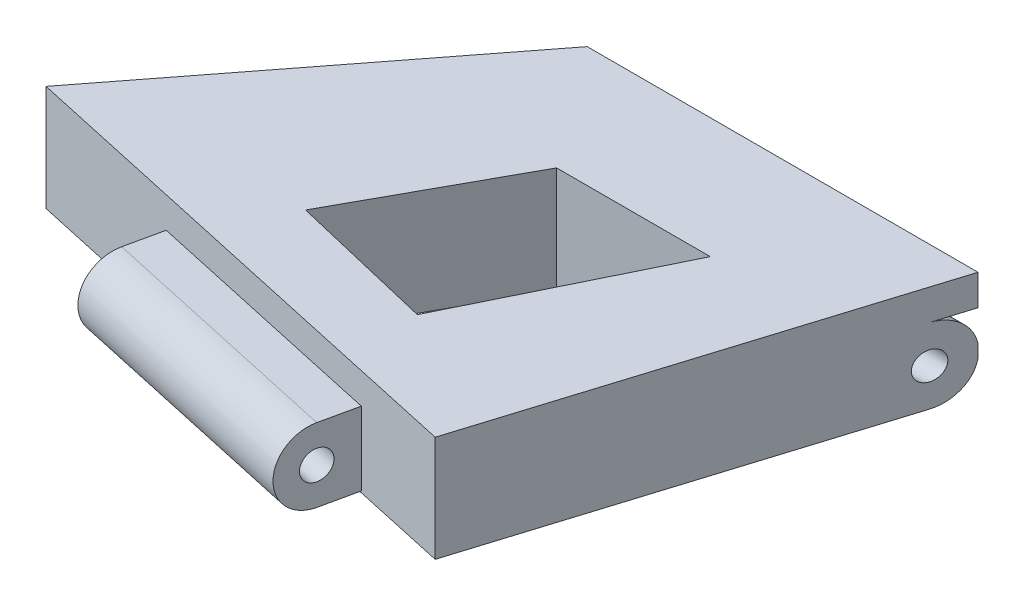
ISO-10303-21;
HEADER;
FILE_DESCRIPTION(('STEP AP214'),'2;1');
FILE_NAME('part.step','',(''),(''),'','','');
FILE_SCHEMA(('AUTOMOTIVE_DESIGN { 1 0 10303 214 1 1 1 1 }'));
ENDSEC;
DATA;
#1=APPLICATION_CONTEXT('core data for automotive mechanical design processes');
#2=APPLICATION_PROTOCOL_DEFINITION('international standard','automotive_design',2000,#1);
#3=PRODUCT_CONTEXT('',#1,'mechanical');
#4=PRODUCT('Part','Part','',(#3));
#5=PRODUCT_RELATED_PRODUCT_CATEGORY('part','',(#4));
#6=PRODUCT_DEFINITION_FORMATION('','',#4);
#7=PRODUCT_DEFINITION_CONTEXT('part definition',#1,'design');
#8=PRODUCT_DEFINITION('design','',#6,#7);
#9=PRODUCT_DEFINITION_SHAPE('','',#8);
#10=(LENGTH_UNIT() NAMED_UNIT(*) SI_UNIT(.MILLI.,.METRE.));
#11=(NAMED_UNIT(*) PLANE_ANGLE_UNIT() SI_UNIT($,.RADIAN.));
#12=(NAMED_UNIT(*) SI_UNIT($,.STERADIAN.) SOLID_ANGLE_UNIT());
#13=UNCERTAINTY_MEASURE_WITH_UNIT(LENGTH_MEASURE(1.E-05),#10,'distance_accuracy_value','');
#14=(GEOMETRIC_REPRESENTATION_CONTEXT(3) GLOBAL_UNCERTAINTY_ASSIGNED_CONTEXT((#13)) GLOBAL_UNIT_ASSIGNED_CONTEXT((#10,
#11,#12)) REPRESENTATION_CONTEXT('',''));
#15=CARTESIAN_POINT('',(0.,0.,0.));
#16=DIRECTION('',(0.,0.,1.));
#17=DIRECTION('',(1.,0.,0.));
#18=AXIS2_PLACEMENT_3D('',#15,#16,#17);
#19=CARTESIAN_POINT('',(0.,15.24,0.));
#20=DIRECTION('',(0.,0.,1.));
#21=DIRECTION('',(1.,0.,0.));
#22=AXIS2_PLACEMENT_3D('',#19,#20,#21);
#23=PLANE('',#22);
#24=DIRECTION('',(1.,0.,0.));
#25=VECTOR('',#24,1.);
#26=CARTESIAN_POINT('',(-10.8042377561624,12.7,0.));
#27=LINE('',#26,#25);
#28=CARTESIAN_POINT('',(0.,12.7,0.));
#29=VERTEX_POINT('',#28);
#30=CARTESIAN_POINT('',(19.0568112466378,12.7,0.));
#31=VERTEX_POINT('',#30);
#32=EDGE_CURVE('E278',#29,#31,#27,.T.);
#33=ORIENTED_EDGE('',*,*,#32,.T.);
#34=DIRECTION('',(0.,-1.,0.));
#35=VECTOR('',#34,1.);
#36=CARTESIAN_POINT('',(19.0568112466378,15.24,0.));
#37=LINE('',#36,#35);
#38=CARTESIAN_POINT('',(19.0568112466378,6.50687140227221,0.));
#39=VERTEX_POINT('',#38);
#40=EDGE_CURVE('E413',#31,#39,#37,.T.);
#41=ORIENTED_EDGE('',*,*,#40,.T.);
#42=DIRECTION('',(-1.,0.,0.));
#43=VECTOR('',#42,1.);
#44=CARTESIAN_POINT('',(33.782,6.50687140227221,0.));
#45=LINE('',#44,#43);
#46=CARTESIAN_POINT('',(0.,6.50687140227221,0.));
#47=VERTEX_POINT('',#46);
#48=EDGE_CURVE('E312',#39,#47,#45,.T.);
#49=ORIENTED_EDGE('',*,*,#48,.T.);
#50=DIRECTION('',(0.,-1.,0.));
#51=VECTOR('',#50,1.);
#52=CARTESIAN_POINT('',(0.,15.24,0.));
#53=LINE('',#52,#51);
#54=EDGE_CURVE('E410',#29,#47,#53,.T.);
#55=ORIENTED_EDGE('',*,*,#54,.F.);
#56=EDGE_LOOP('',(#33,#41,#49,#55));
#57=FACE_BOUND('',#56,.T.);
#58=ADVANCED_FACE('F115',(#57),#23,.F.);
#59=CARTESIAN_POINT('',(0.,15.24,0.));
#60=DIRECTION('',(0.,1.,0.));
#61=DIRECTION('',(0.,0.,1.));
#62=AXIS2_PLACEMENT_3D('',#59,#60,#61);
#63=PLANE('',#62);
#64=DIRECTION('',(0.296374888035305,0.,-0.955071686179661));
#65=VECTOR('',#64,1.);
#66=CARTESIAN_POINT('',(26.1739973577642,15.24,-6.09789291124779));
#67=LINE('',#66,#65);
#68=CARTESIAN_POINT('',(15.5632254721542,15.24,28.0954487164345));
#69=VERTEX_POINT('',#68);
#70=CARTESIAN_POINT('',(26.1739973577642,15.24,-6.09789291124779));
#71=VERTEX_POINT('',#70);
#72=EDGE_CURVE('E408',#69,#71,#67,.T.);
#73=ORIENTED_EDGE('',*,*,#72,.T.);
#74=DIRECTION('',(-1.,0.,0.));
#75=VECTOR('',#74,1.);
#76=CARTESIAN_POINT('',(26.1739973577642,15.24,-6.09789291124779));
#77=LINE('',#76,#75);
#78=CARTESIAN_POINT('',(-6.0827445987543,15.24,-6.09789291124779));
#79=VERTEX_POINT('',#78);
#80=EDGE_CURVE('E285',#71,#79,#77,.T.);
#81=ORIENTED_EDGE('',*,*,#80,.T.);
#82=DIRECTION('',(-0.612217280034448,0.,0.790689573743845));
#83=VECTOR('',#82,1.);
#84=CARTESIAN_POINT('',(-6.0827445987543,15.24,-6.09789291124779));
#85=LINE('',#84,#83);
#86=CARTESIAN_POINT('',(-25.576280294875,15.24,19.0783573073982));
#87=VERTEX_POINT('',#86);
#88=EDGE_CURVE('E404',#79,#87,#85,.T.);
#89=ORIENTED_EDGE('',*,*,#88,.T.);
#90=DIRECTION('',(0.976811581586904,0.,0.214100756835867));
#91=VECTOR('',#90,1.);
#92=CARTESIAN_POINT('',(-25.576280294875,15.24,19.0783573073982));
#93=LINE('',#92,#91);
#94=EDGE_CURVE('E406',#87,#69,#93,.T.);
#95=ORIENTED_EDGE('',*,*,#94,.T.);
#96=EDGE_LOOP('',(#73,#81,#89,#95));
#97=FACE_BOUND('',#96,.T.);
#98=DIRECTION('',(-0.439450333434113,0.,0.898266889317783));
#99=VECTOR('',#98,1.);
#100=CARTESIAN_POINT('',(12.8171164584671,15.24,6.27039265091359));
#101=LINE('',#100,#99);
#102=CARTESIAN_POINT('',(14.0089507072881,15.24,3.83420097731839));
#103=VERTEX_POINT('',#102);
#104=CARTESIAN_POINT('',(6.06632519195569,15.24,20.0694771208587));
#105=VERTEX_POINT('',#104);
#106=EDGE_CURVE('E300',#103,#105,#101,.T.);
#107=ORIENTED_EDGE('',*,*,#106,.T.);
#108=DIRECTION('',(-0.97303332595613,0.,-0.230664575907856));
#109=VECTOR('',#108,1.);
#110=CARTESIAN_POINT('',(-4.18171434727036,15.24,17.6401053499796));
#111=LINE('',#110,#109);
#112=CARTESIAN_POINT('',(-6.02887631894472,15.24,17.2022222667761));
#113=VERTEX_POINT('',#112);
#114=EDGE_CURVE('E130',#105,#113,#111,.T.);
#115=ORIENTED_EDGE('',*,*,#114,.T.);
#116=DIRECTION('',(-0.481767188770831,0.,0.876299250155933));
#117=VECTOR('',#116,1.);
#118=CARTESIAN_POINT('',(2.63272408003637,15.24,1.44740518564029));
#119=LINE('',#118,#117);
#120=CARTESIAN_POINT('',(1.3205240541637,15.24,3.83420097731839));
#121=VERTEX_POINT('',#120);
#122=EDGE_CURVE('E306',#121,#113,#119,.T.);
#123=ORIENTED_EDGE('',*,*,#122,.F.);
#124=DIRECTION('',(1.,0.,0.));
#125=VECTOR('',#124,1.);
#126=CARTESIAN_POINT('',(0.,15.24,3.83420097731839));
#127=LINE('',#126,#125);
#128=EDGE_CURVE('E303',#121,#103,#127,.T.);
#129=ORIENTED_EDGE('',*,*,#128,.T.);
#130=EDGE_LOOP('',(#107,#115,#123,#129));
#131=FACE_BOUND('',#130,.T.);
#132=ADVANCED_FACE('F468',(#97,#131),#63,.T.);
#133=CARTESIAN_POINT('',(-18.5351887533622,6.50687140227221,0.));
#134=DIRECTION('',(0.,1.,0.));
#135=DIRECTION('',(0.,0.,1.));
#136=AXIS2_PLACEMENT_3D('',#133,#134,#135);
#137=PLANE('',#136);
#138=DIRECTION('',(0.,0.,-1.));
#139=VECTOR('',#138,1.);
#140=CARTESIAN_POINT('',(0.,6.50687140227221,0.));
#141=LINE('',#140,#139);
#142=CARTESIAN_POINT('',(0.,6.50687140227221,-3.04894645562389));
#143=VERTEX_POINT('',#142);
#144=EDGE_CURVE('E349',#47,#143,#141,.T.);
#145=ORIENTED_EDGE('',*,*,#144,.F.);
#146=ORIENTED_EDGE('',*,*,#48,.F.);
#147=DIRECTION('',(0.,0.,1.));
#148=VECTOR('',#147,1.);
#149=CARTESIAN_POINT('',(19.0568112466378,6.50687140227221,0.));
#150=LINE('',#149,#148);
#151=CARTESIAN_POINT('',(19.0568112466378,6.50687140227221,-3.04894645562389));
#152=VERTEX_POINT('',#151);
#153=EDGE_CURVE('E346',#152,#39,#150,.T.);
#154=ORIENTED_EDGE('',*,*,#153,.F.);
#155=DIRECTION('',(1.,0.,0.));
#156=VECTOR('',#155,1.);
#157=CARTESIAN_POINT('',(-18.5351887533622,6.50687140227221,-3.04894645562389));
#158=LINE('',#157,#156);
#159=CARTESIAN_POINT('',(25.2278577354854,6.50687140227221,-3.04894645562389));
#160=VERTEX_POINT('',#159);
#161=EDGE_CURVE('E322',#152,#160,#158,.T.);
#162=ORIENTED_EDGE('',*,*,#161,.T.);
#163=DIRECTION('',(0.296374888035305,0.,-0.955071686179661));
#164=VECTOR('',#163,1.);
#165=CARTESIAN_POINT('',(26.1739973577642,6.50687140227221,-6.09789291124779));
#166=LINE('',#165,#164);
#167=CARTESIAN_POINT('',(15.5632254721542,6.50687140227221,28.0954487164345));
#168=VERTEX_POINT('',#167);
#169=EDGE_CURVE('E341',#168,#160,#166,.T.);
#170=ORIENTED_EDGE('',*,*,#169,.F.);
#171=DIRECTION('',(-0.976811581586904,0.,-0.214100756835867));
#172=VECTOR('',#171,1.);
#173=CARTESIAN_POINT('',(7.75241867234352,6.50687140227221,26.3834505390363));
#174=LINE('',#173,#172);
#175=CARTESIAN_POINT('',(-25.576280294875,6.50687140227221,19.0783573073982));
#176=VERTEX_POINT('',#175);
#177=EDGE_CURVE('E318',#168,#176,#174,.T.);
#178=ORIENTED_EDGE('',*,*,#177,.T.);
#179=DIRECTION('',(-0.612217280034448,0.,0.790689573743845));
#180=VECTOR('',#179,1.);
#181=CARTESIAN_POINT('',(-6.0827445987543,6.50687140227221,-6.09789291124779));
#182=LINE('',#181,#180);
#183=CARTESIAN_POINT('',(-8.44349117745833,6.50687140227221,-3.04894645562389));
#184=VERTEX_POINT('',#183);
#185=EDGE_CURVE('E344',#184,#176,#182,.T.);
#186=ORIENTED_EDGE('',*,*,#185,.F.);
#187=EDGE_CURVE('E325',#184,#143,#158,.T.);
#188=ORIENTED_EDGE('',*,*,#187,.T.);
#189=EDGE_LOOP('',(#145,#146,#154,#162,#170,#178,#186,#188));
#190=FACE_BOUND('',#189,.T.);
#191=DIRECTION('',(-0.97303332595613,0.,-0.230664575907856));
#192=VECTOR('',#191,1.);
#193=CARTESIAN_POINT('',(-21.7307171309564,6.50687140227221,13.4799875238741));
#194=LINE('',#193,#192);
#195=CARTESIAN_POINT('',(6.06632519195569,6.50687140227221,20.0694771208587));
#196=VERTEX_POINT('',#195);
#197=CARTESIAN_POINT('',(-6.02887631894472,6.50687140227221,17.2022222667761));
#198=VERTEX_POINT('',#197);
#199=EDGE_CURVE('E12',#196,#198,#194,.T.);
#200=ORIENTED_EDGE('',*,*,#199,.F.);
#201=DIRECTION('',(-0.439450333434113,0.,0.898266889317783));
#202=VECTOR('',#201,1.);
#203=CARTESIAN_POINT('',(9.23766390844195,6.50687140227221,13.5870413434872));
#204=LINE('',#203,#202);
#205=CARTESIAN_POINT('',(14.0089507072881,6.50687140227221,3.83420097731839));
#206=VERTEX_POINT('',#205);
#207=EDGE_CURVE('E450',#206,#196,#204,.T.);
#208=ORIENTED_EDGE('',*,*,#207,.F.);
#209=DIRECTION('',(1.,0.,0.));
#210=VECTOR('',#209,1.);
#211=CARTESIAN_POINT('',(-18.5351887533622,6.50687140227221,3.83420097731839));
#212=LINE('',#211,#210);
#213=CARTESIAN_POINT('',(1.3205240541637,6.50687140227221,3.83420097731839));
#214=VERTEX_POINT('',#213);
#215=EDGE_CURVE('E452',#214,#206,#212,.T.);
#216=ORIENTED_EDGE('',*,*,#215,.F.);
#217=DIRECTION('',(-0.481767188770831,0.,0.876299250155933));
#218=VECTOR('',#217,1.);
#219=CARTESIAN_POINT('',(-1.66928626365299,6.50687140227221,9.27244708597467));
#220=LINE('',#219,#218);
#221=EDGE_CURVE('E123',#214,#198,#220,.T.);
#222=ORIENTED_EDGE('',*,*,#221,.T.);
#223=EDGE_LOOP('',(#200,#208,#216,#222));
#224=FACE_BOUND('',#223,.T.);
#225=ADVANCED_FACE('F457',(#190,#224),#137,.F.);
#226=CARTESIAN_POINT('',(-6.0827445987543,15.24,-6.09789291124779));
#227=DIRECTION('',(0.790689573743845,0.,0.612217280034448));
#228=DIRECTION('',(0.612217280034448,0.,-0.790689573743845));
#229=AXIS2_PLACEMENT_3D('',#226,#227,#228);
#230=PLANE('',#229);
#231=ORIENTED_EDGE('',*,*,#88,.F.);
#232=DIRECTION('',(0.,1.,0.));
#233=VECTOR('',#232,1.);
#234=CARTESIAN_POINT('',(-6.0827445987543,12.7,-6.09789291124779));
#235=LINE('',#234,#233);
#236=CARTESIAN_POINT('',(-6.0827445987543,12.7,-6.09789291124779));
#237=VERTEX_POINT('',#236);
#238=EDGE_CURVE('E286',#237,#79,#235,.T.);
#239=ORIENTED_EDGE('',*,*,#238,.F.);
#240=DIRECTION('',(-0.612217280034448,0.,0.790689573743845));
#241=VECTOR('',#240,1.);
#242=CARTESIAN_POINT('',(-6.0827445987543,12.7,-6.09789291124779));
#243=LINE('',#242,#241);
#244=CARTESIAN_POINT('',(-8.44349117745833,12.7,-3.0489464556239));
#245=VERTEX_POINT('',#244);
#246=EDGE_CURVE('E293',#237,#245,#243,.T.);
#247=ORIENTED_EDGE('',*,*,#246,.T.);
#248=CARTESIAN_POINT('',(-8.44349117745833,9.60343570113611,-3.04894645562389));
#249=DIRECTION('',(0.790689573743845,0.,0.612217280034448));
#250=DIRECTION('',(-0.612217280034448,0.,0.790689573743845));
#251=AXIS2_PLACEMENT_3D('',#248,#249,#250);
#252=ELLIPSE('',#251,3.91628320606524,3.0965642988639);
#253=CARTESIAN_POINT('',(-6.0827445987543,10.1443940800683,-6.09789291124779));
#254=VERTEX_POINT('',#253);
#255=EDGE_CURVE('E334',#254,#245,#252,.T.);
#256=ORIENTED_EDGE('',*,*,#255,.F.);
#257=DIRECTION('',(0.,-1.,0.));
#258=VECTOR('',#257,1.);
#259=CARTESIAN_POINT('',(-6.0827445987543,15.24,-6.09789291124779));
#260=LINE('',#259,#258);
#261=CARTESIAN_POINT('',(-6.0827445987543,9.0624773222039,-6.09789291124779));
#262=VERTEX_POINT('',#261);
#263=EDGE_CURVE('E434',#254,#262,#260,.T.);
#264=ORIENTED_EDGE('',*,*,#263,.T.);
#265=CARTESIAN_POINT('',(-8.44349117745833,9.60343570113611,-3.04894645562389));
#266=DIRECTION('',(0.790689573743845,0.,0.612217280034448));
#267=DIRECTION('',(0.612217280034448,0.,-0.790689573743845));
#268=AXIS2_PLACEMENT_3D('',#265,#266,#267);
#269=ELLIPSE('',#268,3.91628320606524,3.0965642988639);
#270=EDGE_CURVE('E362',#262,#184,#269,.F.);
#271=ORIENTED_EDGE('',*,*,#270,.T.);
#272=ORIENTED_EDGE('',*,*,#185,.T.);
#273=DIRECTION('',(0.,-1.,0.));
#274=VECTOR('',#273,1.);
#275=CARTESIAN_POINT('',(-25.576280294875,15.24,19.0783573073982));
#276=LINE('',#275,#274);
#277=EDGE_CURVE('E431',#87,#176,#276,.T.);
#278=ORIENTED_EDGE('',*,*,#277,.F.);
#279=EDGE_LOOP('',(#231,#239,#247,#256,#264,#271,#272,#278));
#280=FACE_BOUND('',#279,.T.);
#281=CARTESIAN_POINT('',(-8.44349117745833,9.60343570113611,-3.04894645562389));
#282=DIRECTION('',(0.790689573743845,0.,0.612217280034448));
#283=DIRECTION('',(0.612217280034448,0.,-0.790689573743845));
#284=AXIS2_PLACEMENT_3D('',#281,#282,#283);
#285=ELLIPSE('',#284,1.45276285654971,1.14868444379618);
#286=CARTESIAN_POINT('',(-7.55408465288639,9.60343570113611,-4.19763089942008));
#287=VERTEX_POINT('',#286);
#288=EDGE_CURVE('E353',#287,#287,#285,.F.);
#289=ORIENTED_EDGE('',*,*,#288,.F.);
#290=EDGE_LOOP('',(#289));
#291=FACE_BOUND('',#290,.T.);
#292=ADVANCED_FACE('F507',(#280,#291),#230,.F.);
#293=CARTESIAN_POINT('',(26.1739973577642,15.24,-6.09789291124779));
#294=DIRECTION('',(-0.955071686179661,0.,-0.296374888035305));
#295=DIRECTION('',(-0.296374888035305,0.,0.955071686179661));
#296=AXIS2_PLACEMENT_3D('',#293,#294,#295);
#297=PLANE('',#296);
#298=DIRECTION('',(0.,1.,0.));
#299=VECTOR('',#298,1.);
#300=CARTESIAN_POINT('',(26.1739973577642,12.7,-6.09789291124779));
#301=LINE('',#300,#299);
#302=CARTESIAN_POINT('',(26.1739973577642,12.7,-6.09789291124779));
#303=VERTEX_POINT('',#302);
#304=EDGE_CURVE('E270',#303,#71,#301,.T.);
#305=ORIENTED_EDGE('',*,*,#304,.T.);
#306=ORIENTED_EDGE('',*,*,#72,.F.);
#307=DIRECTION('',(0.,-1.,0.));
#308=VECTOR('',#307,1.);
#309=CARTESIAN_POINT('',(15.5632254721542,15.24,28.0954487164345));
#310=LINE('',#309,#308);
#311=EDGE_CURVE('E422',#69,#168,#310,.T.);
#312=ORIENTED_EDGE('',*,*,#311,.T.);
#313=ORIENTED_EDGE('',*,*,#169,.T.);
#314=CARTESIAN_POINT('',(25.2278577354854,9.60343570113611,-3.04894645562389));
#315=DIRECTION('',(-0.955071686179661,0.,-0.296374888035305));
#316=DIRECTION('',(0.296374888035305,0.,-0.955071686179661));
#317=AXIS2_PLACEMENT_3D('',#314,#315,#316);
#318=ELLIPSE('',#317,3.24223233048645,3.0965642988639);
#319=CARTESIAN_POINT('',(26.1739973577642,9.0624773222039,-6.09789291124779));
#320=VERTEX_POINT('',#319);
#321=EDGE_CURVE('E445',#160,#320,#318,.F.);
#322=ORIENTED_EDGE('',*,*,#321,.T.);
#323=DIRECTION('',(0.,-1.,0.));
#324=VECTOR('',#323,1.);
#325=CARTESIAN_POINT('',(26.1739973577642,15.24,-6.09789291124779));
#326=LINE('',#325,#324);
#327=CARTESIAN_POINT('',(26.1739973577642,10.1443940800683,-6.09789291124779));
#328=VERTEX_POINT('',#327);
#329=EDGE_CURVE('E419',#328,#320,#326,.T.);
#330=ORIENTED_EDGE('',*,*,#329,.F.);
#331=CARTESIAN_POINT('',(25.2278577354854,9.60343570113611,-3.04894645562389));
#332=DIRECTION('',(-0.955071686179661,0.,-0.296374888035305));
#333=DIRECTION('',(-0.296374888035305,0.,0.955071686179661));
#334=AXIS2_PLACEMENT_3D('',#331,#332,#333);
#335=ELLIPSE('',#334,3.24223233048645,3.0965642988639);
#336=CARTESIAN_POINT('',(25.2278577354854,12.7,-3.04894645562389));
#337=VERTEX_POINT('',#336);
#338=EDGE_CURVE('E273',#337,#328,#335,.T.);
#339=ORIENTED_EDGE('',*,*,#338,.F.);
#340=DIRECTION('',(0.296374888035305,0.,-0.955071686179661));
#341=VECTOR('',#340,1.);
#342=CARTESIAN_POINT('',(24.2817181132067,12.7,0.));
#343=LINE('',#342,#341);
#344=EDGE_CURVE('E265',#337,#303,#343,.T.);
#345=ORIENTED_EDGE('',*,*,#344,.T.);
#346=EDGE_LOOP('',(#305,#306,#312,#313,#322,#330,#339,#345));
#347=FACE_BOUND('',#346,.T.);
#348=CARTESIAN_POINT('',(25.2278577354854,9.60343570113611,-3.04894645562389));
#349=DIRECTION('',(-0.955071686179661,0.,-0.296374888035305));
#350=DIRECTION('',(0.296374888035305,0.,-0.955071686179661));
#351=AXIS2_PLACEMENT_3D('',#348,#349,#350);
#352=ELLIPSE('',#351,1.20272065481386,1.14868444379618);
#353=CARTESIAN_POINT('',(25.5843139348936,9.60343570113611,-4.19763089942008));
#354=VERTEX_POINT('',#353);
#355=EDGE_CURVE('E352',#354,#354,#352,.F.);
#356=ORIENTED_EDGE('',*,*,#355,.F.);
#357=EDGE_LOOP('',(#356));
#358=FACE_BOUND('',#357,.T.);
#359=ADVANCED_FACE('F267',(#347,#358),#297,.F.);
#360=CARTESIAN_POINT('',(7.75241867234352,15.24,26.3834505390363));
#361=DIRECTION('',(0.214100756835867,0.,-0.976811581586904));
#362=DIRECTION('',(-0.976811581586904,0.,-0.214100756835867));
#363=AXIS2_PLACEMENT_3D('',#360,#361,#362);
#364=PLANE('',#363);
#365=DIRECTION('',(0.976811581586904,0.,0.214100756835866));
#366=VECTOR('',#365,1.);
#367=CARTESIAN_POINT('',(-18.0510360668562,6.63240425099685,20.7277649464601));
#368=LINE('',#367,#366);
#369=CARTESIAN_POINT('',(-12.8695199198941,6.63240425099685,21.8634666002218));
#370=VERTEX_POINT('',#369);
#371=CARTESIAN_POINT('',(7.75241867234352,6.63240425099685,26.3834505390363));
#372=VERTEX_POINT('',#371);
#373=EDGE_CURVE('E383',#370,#372,#368,.T.);
#374=ORIENTED_EDGE('',*,*,#373,.F.);
#375=DIRECTION('',(0.,-1.,0.));
#376=VECTOR('',#375,1.);
#377=CARTESIAN_POINT('',(-12.8695199198941,15.24,21.8634666002218));
#378=LINE('',#377,#376);
#379=CARTESIAN_POINT('',(-12.8695199198941,12.7,21.8634666002218));
#380=VERTEX_POINT('',#379);
#381=EDGE_CURVE('E428',#380,#370,#378,.T.);
#382=ORIENTED_EDGE('',*,*,#381,.F.);
#383=DIRECTION('',(-0.976811581586904,0.,-0.214100756835867));
#384=VECTOR('',#383,1.);
#385=CARTESIAN_POINT('',(-12.8695199198941,12.7,21.8634666002218));
#386=LINE('',#385,#384);
#387=CARTESIAN_POINT('',(7.75241867234352,12.7,26.3834505390363));
#388=VERTEX_POINT('',#387);
#389=EDGE_CURVE('E402',#388,#380,#386,.T.);
#390=ORIENTED_EDGE('',*,*,#389,.F.);
#391=DIRECTION('',(0.,-1.,0.));
#392=VECTOR('',#391,1.);
#393=CARTESIAN_POINT('',(7.75241867234352,15.24,26.3834505390363));
#394=LINE('',#393,#392);
#395=EDGE_CURVE('E425',#388,#372,#394,.T.);
#396=ORIENTED_EDGE('',*,*,#395,.T.);
#397=EDGE_LOOP('',(#374,#382,#390,#396));
#398=FACE_BOUND('',#397,.T.);
#399=ORIENTED_EDGE('',*,*,#177,.F.);
#400=ORIENTED_EDGE('',*,*,#311,.F.);
#401=ORIENTED_EDGE('',*,*,#94,.F.);
#402=ORIENTED_EDGE('',*,*,#277,.T.);
#403=EDGE_LOOP('',(#399,#400,#401,#402));
#404=FACE_BOUND('',#403,.T.);
#405=ADVANCED_FACE('F506',(#398,#404),#364,.F.);
#406=CARTESIAN_POINT('',(0.,15.24,0.));
#407=DIRECTION('',(-1.,0.,0.));
#408=DIRECTION('',(0.,0.,1.));
#409=AXIS2_PLACEMENT_3D('',#406,#407,#408);
#410=PLANE('',#409);
#411=CARTESIAN_POINT('',(0.,9.60343570113611,-3.04894645562389));
#412=DIRECTION('',(-1.,0.,0.));
#413=DIRECTION('',(0.,0.,1.));
#414=AXIS2_PLACEMENT_3D('',#411,#412,#413);
#415=CIRCLE('',#414,3.0965642988639);
#416=CARTESIAN_POINT('',(0.,12.7,-3.04894645562389));
#417=VERTEX_POINT('',#416);
#418=CARTESIAN_POINT('',(0.,10.1443940800683,-6.09789291124779));
#419=VERTEX_POINT('',#418);
#420=EDGE_CURVE('E339',#417,#419,#415,.T.);
#421=ORIENTED_EDGE('',*,*,#420,.F.);
#422=DIRECTION('',(0.,0.,-1.));
#423=VECTOR('',#422,1.);
#424=CARTESIAN_POINT('',(0.,12.7,0.));
#425=LINE('',#424,#423);
#426=EDGE_CURVE('E372',#29,#417,#425,.T.);
#427=ORIENTED_EDGE('',*,*,#426,.F.);
#428=ORIENTED_EDGE('',*,*,#54,.T.);
#429=ORIENTED_EDGE('',*,*,#144,.T.);
#430=CARTESIAN_POINT('',(0.,9.60343570113611,-3.04894645562389));
#431=DIRECTION('',(-1.,0.,0.));
#432=DIRECTION('',(0.,0.,1.));
#433=AXIS2_PLACEMENT_3D('',#430,#431,#432);
#434=CIRCLE('',#433,3.0965642988639);
#435=CARTESIAN_POINT('',(0.,9.0624773222039,-6.09789291124779));
#436=VERTEX_POINT('',#435);
#437=EDGE_CURVE('E368',#143,#436,#434,.F.);
#438=ORIENTED_EDGE('',*,*,#437,.T.);
#439=DIRECTION('',(0.,-1.,0.));
#440=VECTOR('',#439,1.);
#441=CARTESIAN_POINT('',(0.,15.24,-6.09789291124779));
#442=LINE('',#441,#440);
#443=EDGE_CURVE('E437',#419,#436,#442,.T.);
#444=ORIENTED_EDGE('',*,*,#443,.F.);
#445=EDGE_LOOP('',(#421,#427,#428,#429,#438,#444));
#446=FACE_BOUND('',#445,.T.);
#447=CARTESIAN_POINT('',(0.,9.60343570113611,-3.04894645562389));
#448=DIRECTION('',(-1.,0.,0.));
#449=DIRECTION('',(0.,0.,1.));
#450=AXIS2_PLACEMENT_3D('',#447,#448,#449);
#451=CIRCLE('',#450,1.14868444379618);
#452=CARTESIAN_POINT('',(0.,9.60343570113611,-1.90026201182771));
#453=VERTEX_POINT('',#452);
#454=EDGE_CURVE('E359',#453,#453,#451,.F.);
#455=ORIENTED_EDGE('',*,*,#454,.F.);
#456=EDGE_LOOP('',(#455));
#457=FACE_BOUND('',#456,.T.);
#458=ADVANCED_FACE('F117',(#446,#457),#410,.F.);
#459=CARTESIAN_POINT('',(0.,15.24,-6.09789291124779));
#460=DIRECTION('',(0.,0.,1.));
#461=DIRECTION('',(1.,0.,0.));
#462=AXIS2_PLACEMENT_3D('',#459,#460,#461);
#463=PLANE('',#462);
#464=DIRECTION('',(-1.,0.,0.));
#465=VECTOR('',#464,1.);
#466=CARTESIAN_POINT('',(35.3128112466378,10.1443940800683,-6.09789291124779));
#467=LINE('',#466,#465);
#468=EDGE_CURVE('E330',#419,#254,#467,.T.);
#469=ORIENTED_EDGE('',*,*,#468,.F.);
#470=ORIENTED_EDGE('',*,*,#443,.T.);
#471=DIRECTION('',(1.,0.,0.));
#472=VECTOR('',#471,1.);
#473=CARTESIAN_POINT('',(-18.5351887533622,9.0624773222039,-6.09789291124779));
#474=LINE('',#473,#472);
#475=EDGE_CURVE('E329',#262,#436,#474,.T.);
#476=ORIENTED_EDGE('',*,*,#475,.F.);
#477=ORIENTED_EDGE('',*,*,#263,.F.);
#478=EDGE_LOOP('',(#469,#470,#476,#477));
#479=FACE_BOUND('',#478,.T.);
#480=ADVANCED_FACE('F502',(#479),#463,.F.);
#481=CARTESIAN_POINT('',(19.0568112466378,15.24,-6.09789291124779));
#482=DIRECTION('',(0.,0.,1.));
#483=DIRECTION('',(1.,0.,0.));
#484=AXIS2_PLACEMENT_3D('',#481,#482,#483);
#485=PLANE('',#484);
#486=CARTESIAN_POINT('',(19.0568112466378,10.1443940800683,-6.09789291124779));
#487=VERTEX_POINT('',#486);
#488=EDGE_CURVE('E326',#328,#487,#467,.T.);
#489=ORIENTED_EDGE('',*,*,#488,.F.);
#490=ORIENTED_EDGE('',*,*,#329,.T.);
#491=CARTESIAN_POINT('',(19.0568112466378,9.0624773222039,-6.09789291124779));
#492=VERTEX_POINT('',#491);
#493=EDGE_CURVE('E327',#492,#320,#474,.T.);
#494=ORIENTED_EDGE('',*,*,#493,.F.);
#495=DIRECTION('',(0.,-1.,0.));
#496=VECTOR('',#495,1.);
#497=CARTESIAN_POINT('',(19.0568112466378,15.24,-6.09789291124779));
#498=LINE('',#497,#496);
#499=EDGE_CURVE('E416',#487,#492,#498,.T.);
#500=ORIENTED_EDGE('',*,*,#499,.F.);
#501=EDGE_LOOP('',(#489,#490,#494,#500));
#502=FACE_BOUND('',#501,.T.);
#503=ADVANCED_FACE('F498',(#502),#485,.F.);
#504=CARTESIAN_POINT('',(19.0568112466378,15.24,0.));
#505=DIRECTION('',(1.,0.,0.));
#506=DIRECTION('',(0.,0.,-1.));
#507=AXIS2_PLACEMENT_3D('',#504,#505,#506);
#508=PLANE('',#507);
#509=CARTESIAN_POINT('',(19.0568112466378,9.60343570113611,-3.04894645562389));
#510=DIRECTION('',(1.,0.,0.));
#511=DIRECTION('',(0.,0.,-1.));
#512=AXIS2_PLACEMENT_3D('',#509,#510,#511);
#513=CIRCLE('',#512,3.0965642988639);
#514=CARTESIAN_POINT('',(19.0568112466378,12.7,-3.04894645562389));
#515=VERTEX_POINT('',#514);
#516=EDGE_CURVE('E336',#487,#515,#513,.T.);
#517=ORIENTED_EDGE('',*,*,#516,.F.);
#518=ORIENTED_EDGE('',*,*,#499,.T.);
#519=CARTESIAN_POINT('',(19.0568112466378,9.60343570113611,-3.04894645562389));
#520=DIRECTION('',(1.,0.,0.));
#521=DIRECTION('',(0.,0.,-1.));
#522=AXIS2_PLACEMENT_3D('',#519,#520,#521);
#523=CIRCLE('',#522,3.0965642988639);
#524=EDGE_CURVE('E365',#492,#152,#523,.F.);
#525=ORIENTED_EDGE('',*,*,#524,.T.);
#526=ORIENTED_EDGE('',*,*,#153,.T.);
#527=ORIENTED_EDGE('',*,*,#40,.F.);
#528=DIRECTION('',(0.,0.,1.));
#529=VECTOR('',#528,1.);
#530=CARTESIAN_POINT('',(19.0568112466378,12.7,-6.09789291124779));
#531=LINE('',#530,#529);
#532=EDGE_CURVE('E371',#515,#31,#531,.T.);
#533=ORIENTED_EDGE('',*,*,#532,.F.);
#534=EDGE_LOOP('',(#517,#518,#525,#526,#527,#533));
#535=FACE_BOUND('',#534,.T.);
#536=CARTESIAN_POINT('',(19.0568112466378,9.60343570113611,-3.04894645562389));
#537=DIRECTION('',(1.,0.,0.));
#538=DIRECTION('',(0.,0.,-1.));
#539=AXIS2_PLACEMENT_3D('',#536,#537,#538);
#540=CIRCLE('',#539,1.14868444379618);
#541=CARTESIAN_POINT('',(19.0568112466378,9.60343570113611,-4.19763089942008));
#542=VERTEX_POINT('',#541);
#543=EDGE_CURVE('E356',#542,#542,#540,.F.);
#544=ORIENTED_EDGE('',*,*,#543,.F.);
#545=EDGE_LOOP('',(#544));
#546=FACE_BOUND('',#545,.T.);
#547=ADVANCED_FACE('F494',(#535,#546),#508,.F.);
#548=CARTESIAN_POINT('',(-12.8695199198941,15.24,21.8634666002218));
#549=DIRECTION('',(0.976811581586904,0.,0.214100756835867));
#550=DIRECTION('',(0.214100756835867,0.,-0.976811581586904));
#551=AXIS2_PLACEMENT_3D('',#548,#549,#550);
#552=PLANE('',#551);
#553=CARTESIAN_POINT('',(-13.5303729925834,9.66620212549842,24.8785373765716));
#554=DIRECTION('',(0.976811581586904,0.,0.214100756835867));
#555=DIRECTION('',(0.214100756835867,0.,-0.976811581586904));
#556=AXIS2_PLACEMENT_3D('',#553,#554,#555);
#557=CIRCLE('',#556,1.19853330436684);
#558=CARTESIAN_POINT('',(-13.2737661050255,9.66620212549842,23.7077961639484));
#559=VERTEX_POINT('',#558);
#560=EDGE_CURVE('E394',#559,#559,#557,.T.);
#561=ORIENTED_EDGE('',*,*,#560,.T.);
#562=EDGE_LOOP('',(#561));
#563=FACE_BOUND('',#562,.T.);
#564=CARTESIAN_POINT('',(-13.5303729925834,9.66620212549842,24.8785373765716));
#565=DIRECTION('',(0.976811581586904,0.,0.214100756835867));
#566=DIRECTION('',(0.214100756835867,0.,-0.976811581586904));
#567=AXIS2_PLACEMENT_3D('',#564,#565,#566);
#568=CIRCLE('',#567,3.03379787450158);
#569=CARTESIAN_POINT('',(-13.5303729925834,12.7,24.8785373765716));
#570=VERTEX_POINT('',#569);
#571=CARTESIAN_POINT('',(-13.5303729925834,6.63240425099685,24.8785373765716));
#572=VERTEX_POINT('',#571);
#573=EDGE_CURVE('E390',#570,#572,#568,.T.);
#574=ORIENTED_EDGE('',*,*,#573,.F.);
#575=DIRECTION('',(-0.214100756835867,0.,0.976811581586904));
#576=VECTOR('',#575,1.);
#577=CARTESIAN_POINT('',(-14.1912260652727,12.7,27.8936081529214));
#578=LINE('',#577,#576);
#579=EDGE_CURVE('E397',#380,#570,#578,.T.);
#580=ORIENTED_EDGE('',*,*,#579,.F.);
#581=ORIENTED_EDGE('',*,*,#381,.T.);
#582=DIRECTION('',(0.214100756835867,0.,-0.976811581586904));
#583=VECTOR('',#582,1.);
#584=CARTESIAN_POINT('',(-12.8695199198941,6.63240425099685,21.8634666002218));
#585=LINE('',#584,#583);
#586=EDGE_CURVE('E392',#572,#370,#585,.T.);
#587=ORIENTED_EDGE('',*,*,#586,.F.);
#588=EDGE_LOOP('',(#574,#580,#581,#587));
#589=FACE_BOUND('',#588,.T.);
#590=ADVANCED_FACE('F497',(#563,#589),#552,.F.);
#591=CARTESIAN_POINT('',(6.43071252696494,15.24,32.4135920917359));
#592=DIRECTION('',(-0.976811581586904,0.,-0.214100756835866));
#593=DIRECTION('',(-0.214100756835866,0.,0.976811581586904));
#594=AXIS2_PLACEMENT_3D('',#591,#592,#593);
#595=PLANE('',#594);
#596=CARTESIAN_POINT('',(7.09156559965423,9.66620212549842,29.3985213153861));
#597=DIRECTION('',(0.976811581586904,0.,0.214100756835866));
#598=DIRECTION('',(0.214100756835866,0.,-0.976811581586904));
#599=AXIS2_PLACEMENT_3D('',#596,#597,#598);
#600=CIRCLE('',#599,1.19853330436684);
#601=CARTESIAN_POINT('',(7.34817248721216,9.66620212549842,28.227780102763));
#602=VERTEX_POINT('',#601);
#603=EDGE_CURVE('E386',#602,#602,#600,.T.);
#604=ORIENTED_EDGE('',*,*,#603,.F.);
#605=EDGE_LOOP('',(#604));
#606=FACE_BOUND('',#605,.T.);
#607=CARTESIAN_POINT('',(7.09156559965423,9.66620212549842,29.3985213153861));
#608=DIRECTION('',(0.976811581586904,0.,0.214100756835866));
#609=DIRECTION('',(0.214100756835866,0.,-0.976811581586904));
#610=AXIS2_PLACEMENT_3D('',#607,#608,#609);
#611=CIRCLE('',#610,3.03379787450158);
#612=CARTESIAN_POINT('',(7.09156559965423,12.7,29.3985213153861));
#613=VERTEX_POINT('',#612);
#614=CARTESIAN_POINT('',(7.09156559965423,6.63240425099685,29.3985213153861));
#615=VERTEX_POINT('',#614);
#616=EDGE_CURVE('E375',#613,#615,#611,.T.);
#617=ORIENTED_EDGE('',*,*,#616,.T.);
#618=DIRECTION('',(0.214100756835866,0.,-0.976811581586904));
#619=VECTOR('',#618,1.);
#620=CARTESIAN_POINT('',(12.9147864347509,6.63240425099685,2.83070512489387));
#621=LINE('',#620,#619);
#622=EDGE_CURVE('E380',#615,#372,#621,.T.);
#623=ORIENTED_EDGE('',*,*,#622,.T.);
#624=ORIENTED_EDGE('',*,*,#395,.F.);
#625=DIRECTION('',(0.214100756835866,0.,-0.976811581586904));
#626=VECTOR('',#625,1.);
#627=CARTESIAN_POINT('',(7.75241867234352,12.7,26.3834505390363));
#628=LINE('',#627,#626);
#629=EDGE_CURVE('E400',#613,#388,#628,.T.);
#630=ORIENTED_EDGE('',*,*,#629,.F.);
#631=EDGE_LOOP('',(#617,#623,#624,#630));
#632=FACE_BOUND('',#631,.T.);
#633=ADVANCED_FACE('F511',(#606,#632),#595,.F.);
#634=CARTESIAN_POINT('',(0.,12.7,0.));
#635=DIRECTION('',(0.,-1.,0.));
#636=DIRECTION('',(0.,0.,-1.));
#637=AXIS2_PLACEMENT_3D('',#634,#635,#636);
#638=PLANE('',#637);
#639=ORIENTED_EDGE('',*,*,#579,.T.);
#640=DIRECTION('',(0.976811581586904,0.,0.214100756835866));
#641=VECTOR('',#640,1.);
#642=CARTESIAN_POINT('',(-18.7118891395455,12.7,23.7428357228099));
#643=LINE('',#642,#641);
#644=EDGE_CURVE('E440',#570,#613,#643,.T.);
#645=ORIENTED_EDGE('',*,*,#644,.T.);
#646=ORIENTED_EDGE('',*,*,#629,.T.);
#647=ORIENTED_EDGE('',*,*,#389,.T.);
#648=EDGE_LOOP('',(#639,#645,#646,#647));
#649=FACE_BOUND('',#648,.T.);
#650=ADVANCED_FACE('F514',(#649),#638,.F.);
#651=CARTESIAN_POINT('',(-12.8886683044488,6.63240425099685,-2.82498046768237));
#652=DIRECTION('',(0.,-1.,0.));
#653=DIRECTION('',(0.,0.,-1.));
#654=AXIS2_PLACEMENT_3D('',#651,#652,#653);
#655=PLANE('',#654);
#656=ORIENTED_EDGE('',*,*,#586,.T.);
#657=ORIENTED_EDGE('',*,*,#373,.T.);
#658=ORIENTED_EDGE('',*,*,#622,.F.);
#659=DIRECTION('',(0.976811581586904,0.,0.214100756835866));
#660=VECTOR('',#659,1.);
#661=CARTESIAN_POINT('',(-18.7118891395455,6.63240425099685,23.7428357228099));
#662=LINE('',#661,#660);
#663=EDGE_CURVE('E384',#572,#615,#662,.T.);
#664=ORIENTED_EDGE('',*,*,#663,.F.);
#665=EDGE_LOOP('',(#656,#657,#658,#664));
#666=FACE_BOUND('',#665,.T.);
#667=ADVANCED_FACE('F569',(#666),#655,.T.);
#668=CARTESIAN_POINT('',(-18.7118891395455,9.66620212549842,23.7428357228099));
#669=DIRECTION('',(0.976811581586904,0.,0.214100756835866));
#670=DIRECTION('',(0.214100756835866,0.,-0.976811581586904));
#671=AXIS2_PLACEMENT_3D('',#668,#669,#670);
#672=CYLINDRICAL_SURFACE('',#671,3.03379787450158);
#673=ORIENTED_EDGE('',*,*,#573,.T.);
#674=ORIENTED_EDGE('',*,*,#663,.T.);
#675=ORIENTED_EDGE('',*,*,#616,.F.);
#676=ORIENTED_EDGE('',*,*,#644,.F.);
#677=EDGE_LOOP('',(#673,#674,#675,#676));
#678=FACE_BOUND('',#677,.T.);
#679=ADVANCED_FACE('F572',(#678),#672,.T.);
#680=CARTESIAN_POINT('',(-18.7118891395455,9.66620212549842,23.7428357228099));
#681=DIRECTION('',(0.976811581586904,0.,0.214100756835866));
#682=DIRECTION('',(0.214100756835866,0.,-0.976811581586904));
#683=AXIS2_PLACEMENT_3D('',#680,#681,#682);
#684=CYLINDRICAL_SURFACE('',#683,1.19853330436684);
#685=ORIENTED_EDGE('',*,*,#603,.T.);
#686=EDGE_LOOP('',(#685));
#687=FACE_BOUND('',#686,.T.);
#688=ORIENTED_EDGE('',*,*,#560,.F.);
#689=EDGE_LOOP('',(#688));
#690=FACE_BOUND('',#689,.T.);
#691=ADVANCED_FACE('F567',(#687,#690),#684,.F.);
#692=CARTESIAN_POINT('',(35.3128112466378,9.60343570113611,-3.04894645562389));
#693=DIRECTION('',(-1.,0.,0.));
#694=DIRECTION('',(0.,0.,1.));
#695=AXIS2_PLACEMENT_3D('',#692,#693,#694);
#696=CYLINDRICAL_SURFACE('',#695,3.0965642988639);
#697=ORIENTED_EDGE('',*,*,#420,.T.);
#698=ORIENTED_EDGE('',*,*,#468,.T.);
#699=ORIENTED_EDGE('',*,*,#255,.T.);
#700=DIRECTION('',(-1.,0.,0.));
#701=VECTOR('',#700,1.);
#702=CARTESIAN_POINT('',(35.3128112466378,12.7,-3.04894645562389));
#703=LINE('',#702,#701);
#704=EDGE_CURVE('E443',#417,#245,#703,.T.);
#705=ORIENTED_EDGE('',*,*,#704,.F.);
#706=EDGE_LOOP('',(#697,#698,#699,#705));
#707=FACE_BOUND('',#706,.T.);
#708=ADVANCED_FACE('F545',(#707),#696,.T.);
#709=ORIENTED_EDGE('',*,*,#516,.T.);
#710=DIRECTION('',(-1.,0.,0.));
#711=VECTOR('',#710,1.);
#712=CARTESIAN_POINT('',(35.3128112466378,12.7,-3.04894645562389));
#713=LINE('',#712,#711);
#714=EDGE_CURVE('E321',#337,#515,#713,.T.);
#715=ORIENTED_EDGE('',*,*,#714,.F.);
#716=ORIENTED_EDGE('',*,*,#338,.T.);
#717=ORIENTED_EDGE('',*,*,#488,.T.);
#718=EDGE_LOOP('',(#709,#715,#716,#717));
#719=FACE_BOUND('',#718,.T.);
#720=ADVANCED_FACE('F559',(#719),#696,.T.);
#721=CARTESIAN_POINT('',(-18.5351887533622,9.60343570113611,-3.04894645562389));
#722=DIRECTION('',(1.,0.,0.));
#723=DIRECTION('',(0.,0.,-1.));
#724=AXIS2_PLACEMENT_3D('',#721,#722,#723);
#725=CYLINDRICAL_SURFACE('',#724,3.0965642988639);
#726=ORIENTED_EDGE('',*,*,#187,.F.);
#727=ORIENTED_EDGE('',*,*,#270,.F.);
#728=ORIENTED_EDGE('',*,*,#475,.T.);
#729=ORIENTED_EDGE('',*,*,#437,.F.);
#730=EDGE_LOOP('',(#726,#727,#728,#729));
#731=FACE_BOUND('',#730,.T.);
#732=ADVANCED_FACE('F539',(#731),#725,.T.);
#733=ORIENTED_EDGE('',*,*,#493,.T.);
#734=ORIENTED_EDGE('',*,*,#321,.F.);
#735=ORIENTED_EDGE('',*,*,#161,.F.);
#736=ORIENTED_EDGE('',*,*,#524,.F.);
#737=EDGE_LOOP('',(#733,#734,#735,#736));
#738=FACE_BOUND('',#737,.T.);
#739=ADVANCED_FACE('F554',(#738),#725,.T.);
#740=CARTESIAN_POINT('',(-18.5351887533622,9.60343570113611,-3.04894645562389));
#741=DIRECTION('',(1.,0.,0.));
#742=DIRECTION('',(0.,0.,-1.));
#743=AXIS2_PLACEMENT_3D('',#740,#741,#742);
#744=CYLINDRICAL_SURFACE('',#743,1.14868444379618);
#745=ORIENTED_EDGE('',*,*,#355,.T.);
#746=EDGE_LOOP('',(#745));
#747=FACE_BOUND('',#746,.T.);
#748=ORIENTED_EDGE('',*,*,#543,.T.);
#749=EDGE_LOOP('',(#748));
#750=FACE_BOUND('',#749,.T.);
#751=ADVANCED_FACE('F479',(#747,#750),#744,.F.);
#752=ORIENTED_EDGE('',*,*,#288,.T.);
#753=EDGE_LOOP('',(#752));
#754=FACE_BOUND('',#753,.T.);
#755=ORIENTED_EDGE('',*,*,#454,.T.);
#756=EDGE_LOOP('',(#755));
#757=FACE_BOUND('',#756,.T.);
#758=ADVANCED_FACE('F472',(#754,#757),#744,.F.);
#759=CARTESIAN_POINT('',(-4.18171434727036,-15.748,17.6401053499796));
#760=DIRECTION('',(0.230664575907856,0.,-0.97303332595613));
#761=DIRECTION('',(-0.97303332595613,0.,-0.230664575907856));
#762=AXIS2_PLACEMENT_3D('',#759,#760,#761);
#763=PLANE('',#762);
#764=ORIENTED_EDGE('',*,*,#199,.T.);
#765=DIRECTION('',(0.,1.,0.));
#766=VECTOR('',#765,1.);
#767=CARTESIAN_POINT('',(-6.02887631894472,-15.748,17.2022222667761));
#768=LINE('',#767,#766);
#769=EDGE_CURVE('E310',#198,#113,#768,.T.);
#770=ORIENTED_EDGE('',*,*,#769,.T.);
#771=ORIENTED_EDGE('',*,*,#114,.F.);
#772=DIRECTION('',(0.,1.,0.));
#773=VECTOR('',#772,1.);
#774=CARTESIAN_POINT('',(6.06632519195569,-15.748,20.0694771208587));
#775=LINE('',#774,#773);
#776=EDGE_CURVE('E309',#196,#105,#775,.T.);
#777=ORIENTED_EDGE('',*,*,#776,.F.);
#778=EDGE_LOOP('',(#764,#770,#771,#777));
#779=FACE_BOUND('',#778,.T.);
#780=ADVANCED_FACE('F470',(#779),#763,.T.);
#781=CARTESIAN_POINT('',(2.63272408003637,-15.748,1.44740518564029));
#782=DIRECTION('',(-0.876299250155933,0.,-0.481767188770831));
#783=DIRECTION('',(-0.481767188770831,0.,0.876299250155933));
#784=AXIS2_PLACEMENT_3D('',#781,#782,#783);
#785=PLANE('',#784);
#786=DIRECTION('',(0.,1.,0.));
#787=VECTOR('',#786,1.);
#788=CARTESIAN_POINT('',(1.3205240541637,-15.748,3.83420097731839));
#789=LINE('',#788,#787);
#790=EDGE_CURVE('E313',#214,#121,#789,.T.);
#791=ORIENTED_EDGE('',*,*,#790,.T.);
#792=ORIENTED_EDGE('',*,*,#122,.T.);
#793=ORIENTED_EDGE('',*,*,#769,.F.);
#794=ORIENTED_EDGE('',*,*,#221,.F.);
#795=EDGE_LOOP('',(#791,#792,#793,#794));
#796=FACE_BOUND('',#795,.T.);
#797=ADVANCED_FACE('F462',(#796),#785,.F.);
#798=CARTESIAN_POINT('',(0.,-15.748,3.83420097731839));
#799=DIRECTION('',(0.,0.,1.));
#800=DIRECTION('',(1.,0.,0.));
#801=AXIS2_PLACEMENT_3D('',#798,#799,#800);
#802=PLANE('',#801);
#803=ORIENTED_EDGE('',*,*,#215,.T.);
#804=DIRECTION('',(0.,1.,0.));
#805=VECTOR('',#804,1.);
#806=CARTESIAN_POINT('',(14.0089507072881,-15.748,3.83420097731839));
#807=LINE('',#806,#805);
#808=EDGE_CURVE('E138',#206,#103,#807,.T.);
#809=ORIENTED_EDGE('',*,*,#808,.T.);
#810=ORIENTED_EDGE('',*,*,#128,.F.);
#811=ORIENTED_EDGE('',*,*,#790,.F.);
#812=EDGE_LOOP('',(#803,#809,#810,#811));
#813=FACE_BOUND('',#812,.T.);
#814=ADVANCED_FACE('F465',(#813),#802,.T.);
#815=CARTESIAN_POINT('',(12.8171164584671,-15.748,6.27039265091359));
#816=DIRECTION('',(-0.898266889317783,0.,-0.439450333434113));
#817=DIRECTION('',(-0.439450333434113,0.,0.898266889317783));
#818=AXIS2_PLACEMENT_3D('',#815,#816,#817);
#819=PLANE('',#818);
#820=ORIENTED_EDGE('',*,*,#207,.T.);
#821=ORIENTED_EDGE('',*,*,#776,.T.);
#822=ORIENTED_EDGE('',*,*,#106,.F.);
#823=ORIENTED_EDGE('',*,*,#808,.F.);
#824=EDGE_LOOP('',(#820,#821,#822,#823));
#825=FACE_BOUND('',#824,.T.);
#826=ADVANCED_FACE('F469',(#825),#819,.T.);
#827=CARTESIAN_POINT('',(0.,12.7,0.));
#828=DIRECTION('',(0.,1.,0.));
#829=DIRECTION('',(0.,0.,1.));
#830=AXIS2_PLACEMENT_3D('',#827,#828,#829);
#831=PLANE('',#830);
#832=ORIENTED_EDGE('',*,*,#32,.F.);
#833=ORIENTED_EDGE('',*,*,#426,.T.);
#834=ORIENTED_EDGE('',*,*,#704,.T.);
#835=ORIENTED_EDGE('',*,*,#246,.F.);
#836=DIRECTION('',(-1.,0.,0.));
#837=VECTOR('',#836,1.);
#838=CARTESIAN_POINT('',(26.1739973577642,12.7,-6.09789291124779));
#839=LINE('',#838,#837);
#840=EDGE_CURVE('E277',#303,#237,#839,.T.);
#841=ORIENTED_EDGE('',*,*,#840,.F.);
#842=ORIENTED_EDGE('',*,*,#344,.F.);
#843=ORIENTED_EDGE('',*,*,#714,.T.);
#844=ORIENTED_EDGE('',*,*,#532,.T.);
#845=EDGE_LOOP('',(#832,#833,#834,#835,#841,#842,#843,#844));
#846=FACE_BOUND('',#845,.T.);
#847=ADVANCED_FACE('F290',(#846),#831,.F.);
#848=CARTESIAN_POINT('',(26.1739973577642,12.7,-6.09789291124779));
#849=DIRECTION('',(0.,0.,-1.));
#850=DIRECTION('',(-1.,0.,0.));
#851=AXIS2_PLACEMENT_3D('',#848,#849,#850);
#852=PLANE('',#851);
#853=ORIENTED_EDGE('',*,*,#80,.F.);
#854=ORIENTED_EDGE('',*,*,#304,.F.);
#855=ORIENTED_EDGE('',*,*,#840,.T.);
#856=ORIENTED_EDGE('',*,*,#238,.T.);
#857=EDGE_LOOP('',(#853,#854,#855,#856));
#858=FACE_BOUND('',#857,.T.);
#859=ADVANCED_FACE('F282',(#858),#852,.T.);
#860=CLOSED_SHELL('',(#58,#132,#225,#292,#359,#405,#458,#480,#503,#547,#590,#633,#650,#667,#679,
#691,#708,#720,#732,#739,#751,#758,#780,#797,#814,#826,#847,#859));
#861=MANIFOLD_SOLID_BREP('B2',#860);
#862=ADVANCED_BREP_SHAPE_REPRESENTATION('',(#18,#861),#14);
#863=SHAPE_DEFINITION_REPRESENTATION(#9,#862);
ENDSEC;
END-ISO-10303-21;
